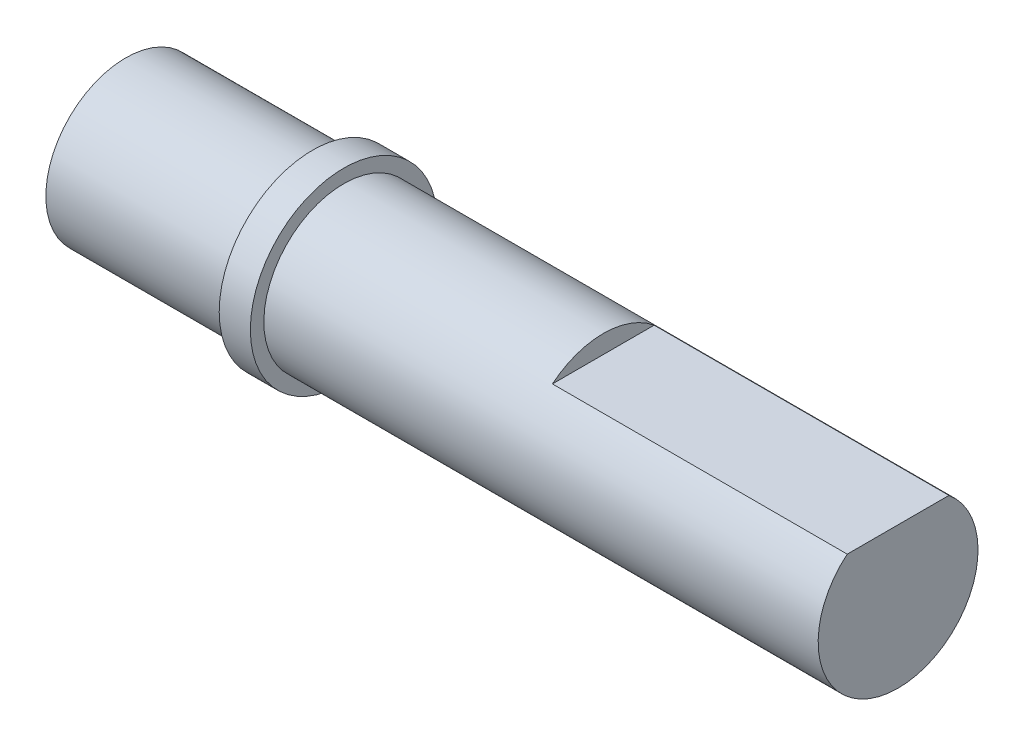
ISO-10303-21;
HEADER;
FILE_DESCRIPTION(('STEP AP214'),'2;1');
FILE_NAME('part.step','',(''),(''),'','','');
FILE_SCHEMA(('AUTOMOTIVE_DESIGN { 1 0 10303 214 1 1 1 1 }'));
ENDSEC;
DATA;
#1=APPLICATION_CONTEXT('core data for automotive mechanical design processes');
#2=APPLICATION_PROTOCOL_DEFINITION('international standard','automotive_design',2000,#1);
#3=PRODUCT_CONTEXT('',#1,'mechanical');
#4=PRODUCT('Part','Part','',(#3));
#5=PRODUCT_RELATED_PRODUCT_CATEGORY('part','',(#4));
#6=PRODUCT_DEFINITION_FORMATION('','',#4);
#7=PRODUCT_DEFINITION_CONTEXT('part definition',#1,'design');
#8=PRODUCT_DEFINITION('design','',#6,#7);
#9=PRODUCT_DEFINITION_SHAPE('','',#8);
#10=(LENGTH_UNIT() NAMED_UNIT(*) SI_UNIT(.MILLI.,.METRE.));
#11=(NAMED_UNIT(*) PLANE_ANGLE_UNIT() SI_UNIT($,.RADIAN.));
#12=(NAMED_UNIT(*) SI_UNIT($,.STERADIAN.) SOLID_ANGLE_UNIT());
#13=UNCERTAINTY_MEASURE_WITH_UNIT(LENGTH_MEASURE(1.E-05),#10,'distance_accuracy_value','');
#14=(GEOMETRIC_REPRESENTATION_CONTEXT(3) GLOBAL_UNCERTAINTY_ASSIGNED_CONTEXT((#13)) GLOBAL_UNIT_ASSIGNED_CONTEXT((#10,
#11,#12)) REPRESENTATION_CONTEXT('',''));
#15=CARTESIAN_POINT('',(0.,0.,0.));
#16=DIRECTION('',(0.,0.,1.));
#17=DIRECTION('',(1.,0.,0.));
#18=AXIS2_PLACEMENT_3D('',#15,#16,#17);
#19=CARTESIAN_POINT('',(28.2,2.9698484809835,0.));
#20=DIRECTION('',(0.,1.,0.));
#21=DIRECTION('',(0.,0.,1.));
#22=AXIS2_PLACEMENT_3D('',#19,#20,#21);
#23=PLANE('',#22);
#24=DIRECTION('',(0.,0.,-1.));
#25=VECTOR('',#24,1.);
#26=CARTESIAN_POINT('',(14.,2.9698484809835,0.));
#27=LINE('',#26,#25);
#28=CARTESIAN_POINT('',(14.,2.9698484809835,2.45));
#29=VERTEX_POINT('',#28);
#30=CARTESIAN_POINT('',(14.,2.9698484809835,-2.45));
#31=VERTEX_POINT('',#30);
#32=EDGE_CURVE('E52',#29,#31,#27,.T.);
#33=ORIENTED_EDGE('',*,*,#32,.F.);
#34=DIRECTION('',(-1.,0.,0.));
#35=VECTOR('',#34,1.);
#36=CARTESIAN_POINT('',(28.2,2.9698484809835,2.45));
#37=LINE('',#36,#35);
#38=CARTESIAN_POINT('',(28.2,2.9698484809835,2.45));
#39=VERTEX_POINT('',#38);
#40=EDGE_CURVE('E11',#39,#29,#37,.T.);
#41=ORIENTED_EDGE('',*,*,#40,.F.);
#42=DIRECTION('',(0.,0.,-1.));
#43=VECTOR('',#42,1.);
#44=CARTESIAN_POINT('',(28.2,2.9698484809835,0.));
#45=LINE('',#44,#43);
#46=CARTESIAN_POINT('',(28.2,2.9698484809835,-2.45));
#47=VERTEX_POINT('',#46);
#48=EDGE_CURVE('E59',#39,#47,#45,.T.);
#49=ORIENTED_EDGE('',*,*,#48,.T.);
#50=DIRECTION('',(-1.,0.,0.));
#51=VECTOR('',#50,1.);
#52=CARTESIAN_POINT('',(28.2,2.9698484809835,-2.45));
#53=LINE('',#52,#51);
#54=EDGE_CURVE('E41',#47,#31,#53,.T.);
#55=ORIENTED_EDGE('',*,*,#54,.T.);
#56=EDGE_LOOP('',(#33,#41,#49,#55));
#57=FACE_BOUND('',#56,.T.);
#58=ADVANCED_FACE('F34',(#57),#23,.T.);
#59=CARTESIAN_POINT('',(28.2,0.,0.));
#60=DIRECTION('',(-1.,0.,0.));
#61=DIRECTION('',(0.,0.,1.));
#62=AXIS2_PLACEMENT_3D('',#59,#60,#61);
#63=CYLINDRICAL_SURFACE('',#62,3.85);
#64=CARTESIAN_POINT('',(1.5,0.,0.));
#65=DIRECTION('',(1.,0.,0.));
#66=DIRECTION('',(0.,0.,-1.));
#67=AXIS2_PLACEMENT_3D('',#64,#65,#66);
#68=CIRCLE('',#67,3.85);
#69=CARTESIAN_POINT('',(1.5,0.,-3.85));
#70=VERTEX_POINT('',#69);
#71=EDGE_CURVE('E70',#70,#70,#68,.T.);
#72=ORIENTED_EDGE('',*,*,#71,.T.);
#73=EDGE_LOOP('',(#72));
#74=FACE_BOUND('',#73,.T.);
#75=ORIENTED_EDGE('',*,*,#40,.T.);
#76=CARTESIAN_POINT('',(14.,0.,0.));
#77=DIRECTION('',(1.,0.,0.));
#78=DIRECTION('',(0.,0.,-1.));
#79=AXIS2_PLACEMENT_3D('',#76,#77,#78);
#80=CIRCLE('',#79,3.85);
#81=EDGE_CURVE('E75',#31,#29,#80,.T.);
#82=ORIENTED_EDGE('',*,*,#81,.F.);
#83=ORIENTED_EDGE('',*,*,#54,.F.);
#84=CARTESIAN_POINT('',(28.2,0.,0.));
#85=DIRECTION('',(1.,0.,0.));
#86=DIRECTION('',(0.,0.,-1.));
#87=AXIS2_PLACEMENT_3D('',#84,#85,#86);
#88=CIRCLE('',#87,3.85);
#89=EDGE_CURVE('E62',#39,#47,#88,.T.);
#90=ORIENTED_EDGE('',*,*,#89,.F.);
#91=EDGE_LOOP('',(#75,#82,#83,#90));
#92=FACE_BOUND('',#91,.T.);
#93=ADVANCED_FACE('F63',(#74,#92),#63,.T.);
#94=CARTESIAN_POINT('',(28.2,0.,0.));
#95=DIRECTION('',(1.,0.,0.));
#96=DIRECTION('',(0.,0.,-1.));
#97=AXIS2_PLACEMENT_3D('',#94,#95,#96);
#98=PLANE('',#97);
#99=ORIENTED_EDGE('',*,*,#48,.F.);
#100=ORIENTED_EDGE('',*,*,#89,.T.);
#101=EDGE_LOOP('',(#99,#100));
#102=FACE_BOUND('',#101,.T.);
#103=ADVANCED_FACE('F66',(#102),#98,.T.);
#104=CARTESIAN_POINT('',(0.,0.,0.));
#105=DIRECTION('',(1.,0.,0.));
#106=DIRECTION('',(0.,0.,-1.));
#107=AXIS2_PLACEMENT_3D('',#104,#105,#106);
#108=PLANE('',#107);
#109=CARTESIAN_POINT('',(0.,0.,0.));
#110=DIRECTION('',(1.,0.,0.));
#111=DIRECTION('',(0.,0.,-1.));
#112=AXIS2_PLACEMENT_3D('',#109,#110,#111);
#113=CIRCLE('',#112,3.85);
#114=CARTESIAN_POINT('',(0.,0.,-3.85));
#115=VERTEX_POINT('',#114);
#116=EDGE_CURVE('E82',#115,#115,#113,.T.);
#117=ORIENTED_EDGE('',*,*,#116,.T.);
#118=EDGE_LOOP('',(#117));
#119=FACE_BOUND('',#118,.T.);
#120=CARTESIAN_POINT('',(0.,0.,0.));
#121=DIRECTION('',(1.,0.,0.));
#122=DIRECTION('',(0.,0.,-1.));
#123=AXIS2_PLACEMENT_3D('',#120,#121,#122);
#124=CIRCLE('',#123,4.5);
#125=CARTESIAN_POINT('',(0.,0.,-4.5));
#126=VERTEX_POINT('',#125);
#127=EDGE_CURVE('E73',#126,#126,#124,.T.);
#128=ORIENTED_EDGE('',*,*,#127,.F.);
#129=EDGE_LOOP('',(#128));
#130=FACE_BOUND('',#129,.T.);
#131=ADVANCED_FACE('F107',(#119,#130),#108,.F.);
#132=CARTESIAN_POINT('',(1.5,0.,0.));
#133=DIRECTION('',(-1.,0.,0.));
#134=DIRECTION('',(0.,0.,1.));
#135=AXIS2_PLACEMENT_3D('',#132,#133,#134);
#136=CYLINDRICAL_SURFACE('',#135,4.5);
#137=CARTESIAN_POINT('',(1.5,0.,0.));
#138=DIRECTION('',(1.,0.,0.));
#139=DIRECTION('',(0.,0.,-1.));
#140=AXIS2_PLACEMENT_3D('',#137,#138,#139);
#141=CIRCLE('',#140,4.5);
#142=CARTESIAN_POINT('',(1.5,0.,-4.5));
#143=VERTEX_POINT('',#142);
#144=EDGE_CURVE('E67',#143,#143,#141,.T.);
#145=ORIENTED_EDGE('',*,*,#144,.F.);
#146=EDGE_LOOP('',(#145));
#147=FACE_BOUND('',#146,.T.);
#148=ORIENTED_EDGE('',*,*,#127,.T.);
#149=EDGE_LOOP('',(#148));
#150=FACE_BOUND('',#149,.T.);
#151=ADVANCED_FACE('F111',(#147,#150),#136,.T.);
#152=CARTESIAN_POINT('',(1.5,0.,0.));
#153=DIRECTION('',(1.,0.,0.));
#154=DIRECTION('',(0.,0.,-1.));
#155=AXIS2_PLACEMENT_3D('',#152,#153,#154);
#156=PLANE('',#155);
#157=ORIENTED_EDGE('',*,*,#71,.F.);
#158=EDGE_LOOP('',(#157));
#159=FACE_BOUND('',#158,.T.);
#160=ORIENTED_EDGE('',*,*,#144,.T.);
#161=EDGE_LOOP('',(#160));
#162=FACE_BOUND('',#161,.T.);
#163=ADVANCED_FACE('F116',(#159,#162),#156,.T.);
#164=CARTESIAN_POINT('',(14.,0.,0.));
#165=DIRECTION('',(1.,0.,0.));
#166=DIRECTION('',(0.,0.,-1.));
#167=AXIS2_PLACEMENT_3D('',#164,#165,#166);
#168=PLANE('',#167);
#169=ORIENTED_EDGE('',*,*,#32,.T.);
#170=ORIENTED_EDGE('',*,*,#81,.T.);
#171=EDGE_LOOP('',(#169,#170));
#172=FACE_BOUND('',#171,.T.);
#173=ADVANCED_FACE('F97',(#172),#168,.T.);
#174=CARTESIAN_POINT('',(-9.,0.,0.));
#175=DIRECTION('',(1.,0.,0.));
#176=DIRECTION('',(0.,0.,-1.));
#177=AXIS2_PLACEMENT_3D('',#174,#175,#176);
#178=CYLINDRICAL_SURFACE('',#177,3.85);
#179=CARTESIAN_POINT('',(-9.,0.,0.));
#180=DIRECTION('',(1.,0.,0.));
#181=DIRECTION('',(0.,0.,-1.));
#182=AXIS2_PLACEMENT_3D('',#179,#180,#181);
#183=CIRCLE('',#182,3.85);
#184=CARTESIAN_POINT('',(-9.,0.,-3.85));
#185=VERTEX_POINT('',#184);
#186=EDGE_CURVE('E81',#185,#185,#183,.T.);
#187=ORIENTED_EDGE('',*,*,#186,.T.);
#188=EDGE_LOOP('',(#187));
#189=FACE_BOUND('',#188,.T.);
#190=ORIENTED_EDGE('',*,*,#116,.F.);
#191=EDGE_LOOP('',(#190));
#192=FACE_BOUND('',#191,.T.);
#193=ADVANCED_FACE('F88',(#189,#192),#178,.T.);
#194=CARTESIAN_POINT('',(-9.,0.,0.));
#195=DIRECTION('',(1.,0.,0.));
#196=DIRECTION('',(0.,0.,-1.));
#197=AXIS2_PLACEMENT_3D('',#194,#195,#196);
#198=PLANE('',#197);
#199=ORIENTED_EDGE('',*,*,#186,.F.);
#200=EDGE_LOOP('',(#199));
#201=FACE_BOUND('',#200,.T.);
#202=ADVANCED_FACE('F91',(#201),#198,.F.);
#203=CLOSED_SHELL('',(#58,#93,#103,#131,#151,#163,#173,#193,#202));
#204=MANIFOLD_SOLID_BREP('B2',#203);
#205=ADVANCED_BREP_SHAPE_REPRESENTATION('',(#18,#204),#14);
#206=SHAPE_DEFINITION_REPRESENTATION(#9,#205);
ENDSEC;
END-ISO-10303-21;
